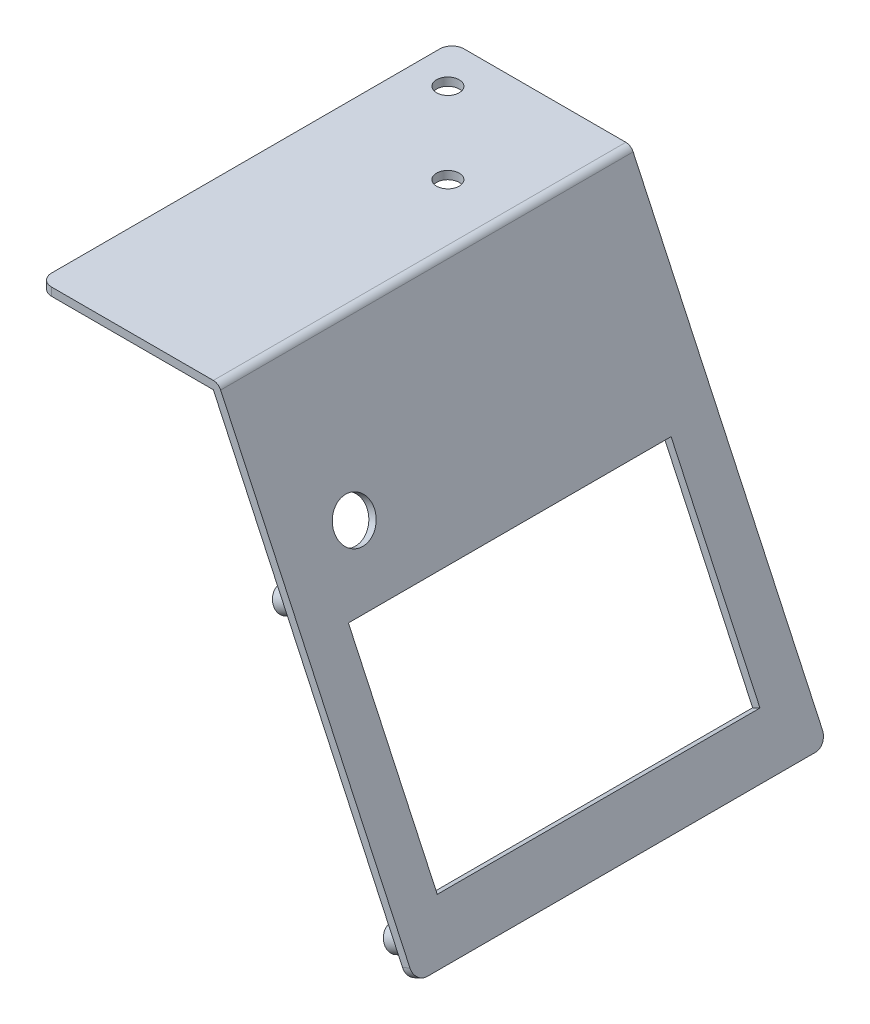
ISO-10303-21;
HEADER;
FILE_DESCRIPTION(('STEP AP214'),'2;1');
FILE_NAME('part.step','',(''),(''),'','','');
FILE_SCHEMA(('AUTOMOTIVE_DESIGN { 1 0 10303 214 1 1 1 1 }'));
ENDSEC;
DATA;
#1=APPLICATION_CONTEXT('core data for automotive mechanical design processes');
#2=APPLICATION_PROTOCOL_DEFINITION('international standard','automotive_design',2000,#1);
#3=PRODUCT_CONTEXT('',#1,'mechanical');
#4=PRODUCT('Part','Part','',(#3));
#5=PRODUCT_RELATED_PRODUCT_CATEGORY('part','',(#4));
#6=PRODUCT_DEFINITION_FORMATION('','',#4);
#7=PRODUCT_DEFINITION_CONTEXT('part definition',#1,'design');
#8=PRODUCT_DEFINITION('design','',#6,#7);
#9=PRODUCT_DEFINITION_SHAPE('','',#8);
#10=(LENGTH_UNIT() NAMED_UNIT(*) SI_UNIT(.MILLI.,.METRE.));
#11=(NAMED_UNIT(*) PLANE_ANGLE_UNIT() SI_UNIT($,.RADIAN.));
#12=(NAMED_UNIT(*) SI_UNIT($,.STERADIAN.) SOLID_ANGLE_UNIT());
#13=UNCERTAINTY_MEASURE_WITH_UNIT(LENGTH_MEASURE(1.E-05),#10,'distance_accuracy_value','');
#14=(GEOMETRIC_REPRESENTATION_CONTEXT(3) GLOBAL_UNCERTAINTY_ASSIGNED_CONTEXT((#13)) GLOBAL_UNIT_ASSIGNED_CONTEXT((#10,
#11,#12)) REPRESENTATION_CONTEXT('',''));
#15=CARTESIAN_POINT('',(0.,0.,0.));
#16=DIRECTION('',(0.,0.,1.));
#17=DIRECTION('',(1.,0.,0.));
#18=AXIS2_PLACEMENT_3D('',#15,#16,#17);
#19=CARTESIAN_POINT('',(34.5538891651414,16.1127431367447,0.));
#20=DIRECTION('',(0.906307787036648,0.422618261740704,0.));
#21=DIRECTION('',(-0.422618261740704,0.906307787036648,0.));
#22=AXIS2_PLACEMENT_3D('',#19,#20,#21);
#23=PLANE('',#22);
#24=CARTESIAN_POINT('',(61.1600718501967,-40.9443997596972,8.04999999999999));
#25=DIRECTION('',(0.906307787036648,0.422618261740704,0.));
#26=DIRECTION('',(-0.422618261740704,0.906307787036648,0.));
#27=AXIS2_PLACEMENT_3D('',#24,#25,#26);
#28=CIRCLE('',#27,1.35);
#29=CARTESIAN_POINT('',(60.5895371968468,-39.7208842471977,8.04999999999999));
#30=VERTEX_POINT('',#29);
#31=EDGE_CURVE('E19',#30,#30,#28,.F.);
#32=ORIENTED_EDGE('',*,*,#31,.T.);
#33=EDGE_LOOP('',(#32));
#34=FACE_BOUND('',#33,.T.);
#35=ADVANCED_FACE('F16',(#34),#23,.F.);
#36=CARTESIAN_POINT('',(34.5538891651414,16.1127431367447,0.));
#37=DIRECTION('',(0.906307787036648,0.422618261740704,0.));
#38=DIRECTION('',(-0.422618261740704,0.906307787036648,0.));
#39=AXIS2_PLACEMENT_3D('',#36,#37,#38);
#40=PLANE('',#39);
#41=CARTESIAN_POINT('',(88.5879970371684,-99.7637751383756,8.04999999999999));
#42=DIRECTION('',(0.906307787036648,0.422618261740704,0.));
#43=DIRECTION('',(-0.422618261740704,0.906307787036648,0.));
#44=AXIS2_PLACEMENT_3D('',#41,#42,#43);
#45=CIRCLE('',#44,1.34999999999999);
#46=CARTESIAN_POINT('',(88.0174623838184,-98.5402596258762,8.04999999999999));
#47=VERTEX_POINT('',#46);
#48=EDGE_CURVE('E232',#47,#47,#45,.F.);
#49=ORIENTED_EDGE('',*,*,#48,.T.);
#50=EDGE_LOOP('',(#49));
#51=FACE_BOUND('',#50,.T.);
#52=ADVANCED_FACE('F381',(#51),#40,.F.);
#53=CARTESIAN_POINT('',(34.5538891651414,16.1127431367447,0.));
#54=DIRECTION('',(0.906307787036648,0.422618261740704,0.));
#55=DIRECTION('',(-0.422618261740704,0.906307787036648,0.));
#56=AXIS2_PLACEMENT_3D('',#53,#54,#55);
#57=PLANE('',#56);
#58=CARTESIAN_POINT('',(88.5879970371684,-99.7637751383756,95.95));
#59=DIRECTION('',(0.906307787036648,0.422618261740704,0.));
#60=DIRECTION('',(-0.422618261740704,0.906307787036648,0.));
#61=AXIS2_PLACEMENT_3D('',#58,#59,#60);
#62=CIRCLE('',#61,1.35000000000001);
#63=CARTESIAN_POINT('',(88.0174623838184,-98.5402596258762,95.95));
#64=VERTEX_POINT('',#63);
#65=EDGE_CURVE('E230',#64,#64,#62,.F.);
#66=ORIENTED_EDGE('',*,*,#65,.T.);
#67=EDGE_LOOP('',(#66));
#68=FACE_BOUND('',#67,.T.);
#69=ADVANCED_FACE('F254',(#68),#57,.F.);
#70=CARTESIAN_POINT('',(34.5538891651414,16.1127431367447,0.));
#71=DIRECTION('',(0.906307787036648,0.422618261740704,0.));
#72=DIRECTION('',(-0.422618261740704,0.906307787036648,0.));
#73=AXIS2_PLACEMENT_3D('',#70,#71,#72);
#74=PLANE('',#73);
#75=CARTESIAN_POINT('',(61.1600718501967,-40.9443997596972,95.95));
#76=DIRECTION('',(0.906307787036648,0.422618261740704,0.));
#77=DIRECTION('',(-0.422618261740704,0.906307787036648,0.));
#78=AXIS2_PLACEMENT_3D('',#75,#76,#77);
#79=CIRCLE('',#78,1.35000000000001);
#80=CARTESIAN_POINT('',(60.5895371968467,-39.7208842471977,95.95));
#81=VERTEX_POINT('',#80);
#82=EDGE_CURVE('E227',#81,#81,#79,.F.);
#83=ORIENTED_EDGE('',*,*,#82,.T.);
#84=EDGE_LOOP('',(#83));
#85=FACE_BOUND('',#84,.T.);
#86=ADVANCED_FACE('F243',(#85),#74,.F.);
#87=CARTESIAN_POINT('',(54.8159173409402,-43.9027275918821,8.04999999999999));
#88=DIRECTION('',(0.906307787036648,0.422618261740704,0.));
#89=DIRECTION('',(-0.422618261740704,0.906307787036648,0.));
#90=AXIS2_PLACEMENT_3D('',#87,#88,#89);
#91=CYLINDRICAL_SURFACE('',#90,1.35);
#92=CARTESIAN_POINT('',(54.8159173409402,-43.9027275918821,8.04999999999999));
#93=DIRECTION('',(0.906307787036648,0.422618261740704,0.));
#94=DIRECTION('',(-0.422618261740704,0.906307787036648,0.));
#95=AXIS2_PLACEMENT_3D('',#92,#93,#94);
#96=CIRCLE('',#95,1.35);
#97=CARTESIAN_POINT('',(54.2453826875902,-42.6792120793826,8.04999999999999));
#98=VERTEX_POINT('',#97);
#99=EDGE_CURVE('E224',#98,#98,#96,.F.);
#100=ORIENTED_EDGE('',*,*,#99,.T.);
#101=EDGE_LOOP('',(#100));
#102=FACE_BOUND('',#101,.T.);
#103=ORIENTED_EDGE('',*,*,#31,.F.);
#104=EDGE_LOOP('',(#103));
#105=FACE_BOUND('',#104,.T.);
#106=ADVANCED_FACE('F240',(#102,#105),#91,.F.);
#107=CARTESIAN_POINT('',(82.2438425279118,-102.722102970561,8.04999999999999));
#108=DIRECTION('',(0.906307787036648,0.422618261740704,0.));
#109=DIRECTION('',(-0.422618261740704,0.906307787036648,0.));
#110=AXIS2_PLACEMENT_3D('',#107,#108,#109);
#111=CYLINDRICAL_SURFACE('',#110,1.34999999999999);
#112=CARTESIAN_POINT('',(82.2438425279118,-102.722102970561,8.04999999999999));
#113=DIRECTION('',(0.906307787036648,0.422618261740704,0.));
#114=DIRECTION('',(-0.422618261740704,0.906307787036648,0.));
#115=AXIS2_PLACEMENT_3D('',#112,#113,#114);
#116=CIRCLE('',#115,1.34999999999999);
#117=CARTESIAN_POINT('',(81.6733078745619,-101.498587458061,8.04999999999999));
#118=VERTEX_POINT('',#117);
#119=EDGE_CURVE('E221',#118,#118,#116,.F.);
#120=ORIENTED_EDGE('',*,*,#119,.T.);
#121=EDGE_LOOP('',(#120));
#122=FACE_BOUND('',#121,.T.);
#123=ORIENTED_EDGE('',*,*,#48,.F.);
#124=EDGE_LOOP('',(#123));
#125=FACE_BOUND('',#124,.T.);
#126=ADVANCED_FACE('F242',(#122,#125),#111,.F.);
#127=CARTESIAN_POINT('',(82.2438425279118,-102.722102970561,95.95));
#128=DIRECTION('',(0.906307787036648,0.422618261740704,0.));
#129=DIRECTION('',(-0.422618261740704,0.906307787036648,0.));
#130=AXIS2_PLACEMENT_3D('',#127,#128,#129);
#131=CYLINDRICAL_SURFACE('',#130,1.35000000000001);
#132=CARTESIAN_POINT('',(82.2438425279118,-102.722102970561,95.95));
#133=DIRECTION('',(0.906307787036648,0.422618261740704,0.));
#134=DIRECTION('',(-0.422618261740704,0.906307787036648,0.));
#135=AXIS2_PLACEMENT_3D('',#132,#133,#134);
#136=CIRCLE('',#135,1.35000000000001);
#137=CARTESIAN_POINT('',(81.6733078745619,-101.498587458061,95.95));
#138=VERTEX_POINT('',#137);
#139=EDGE_CURVE('E218',#138,#138,#136,.F.);
#140=ORIENTED_EDGE('',*,*,#139,.T.);
#141=EDGE_LOOP('',(#140));
#142=FACE_BOUND('',#141,.T.);
#143=ORIENTED_EDGE('',*,*,#65,.F.);
#144=EDGE_LOOP('',(#143));
#145=FACE_BOUND('',#144,.T.);
#146=ADVANCED_FACE('F251',(#142,#145),#131,.F.);
#147=CARTESIAN_POINT('',(54.8159173409402,-43.9027275918821,95.95));
#148=DIRECTION('',(0.906307787036648,0.422618261740704,0.));
#149=DIRECTION('',(-0.422618261740704,0.906307787036648,0.));
#150=AXIS2_PLACEMENT_3D('',#147,#148,#149);
#151=CYLINDRICAL_SURFACE('',#150,1.35000000000001);
#152=CARTESIAN_POINT('',(54.8159173409402,-43.9027275918821,95.95));
#153=DIRECTION('',(0.906307787036648,0.422618261740704,0.));
#154=DIRECTION('',(-0.422618261740704,0.906307787036648,0.));
#155=AXIS2_PLACEMENT_3D('',#152,#153,#154);
#156=CIRCLE('',#155,1.35000000000001);
#157=CARTESIAN_POINT('',(54.2453826875902,-42.6792120793826,95.95));
#158=VERTEX_POINT('',#157);
#159=EDGE_CURVE('E142',#158,#158,#156,.F.);
#160=ORIENTED_EDGE('',*,*,#159,.T.);
#161=EDGE_LOOP('',(#160));
#162=FACE_BOUND('',#161,.T.);
#163=ORIENTED_EDGE('',*,*,#82,.F.);
#164=EDGE_LOOP('',(#163));
#165=FACE_BOUND('',#164,.T.);
#166=ADVANCED_FACE('F367',(#162,#165),#151,.F.);
#167=CARTESIAN_POINT('',(54.8159173409402,-43.9027275918821,8.04999999999999));
#168=DIRECTION('',(0.906307787036648,0.422618261740704,0.));
#169=DIRECTION('',(-0.422618261740704,0.906307787036648,0.));
#170=AXIS2_PLACEMENT_3D('',#167,#168,#169);
#171=PLANE('',#170);
#172=CARTESIAN_POINT('',(54.8159173409402,-43.9027275918821,8.04999999999999));
#173=DIRECTION('',(0.906307787036648,0.422618261740704,0.));
#174=DIRECTION('',(-0.422618261740704,0.906307787036648,0.));
#175=AXIS2_PLACEMENT_3D('',#172,#173,#174);
#176=CIRCLE('',#175,3.);
#177=CARTESIAN_POINT('',(53.5480625557181,-41.1838042307722,8.04999999999999));
#178=VERTEX_POINT('',#177);
#179=EDGE_CURVE('E118',#178,#178,#176,.T.);
#180=ORIENTED_EDGE('',*,*,#179,.F.);
#181=EDGE_LOOP('',(#180));
#182=FACE_BOUND('',#181,.T.);
#183=ORIENTED_EDGE('',*,*,#99,.F.);
#184=EDGE_LOOP('',(#183));
#185=FACE_BOUND('',#184,.T.);
#186=ADVANCED_FACE('F363',(#182,#185),#171,.F.);
#187=CARTESIAN_POINT('',(82.2438425279118,-102.722102970561,8.04999999999999));
#188=DIRECTION('',(0.906307787036648,0.422618261740704,0.));
#189=DIRECTION('',(-0.422618261740704,0.906307787036648,0.));
#190=AXIS2_PLACEMENT_3D('',#187,#188,#189);
#191=PLANE('',#190);
#192=CARTESIAN_POINT('',(82.2438425279118,-102.722102970561,8.04999999999999));
#193=DIRECTION('',(0.906307787036648,0.422618261740704,0.));
#194=DIRECTION('',(-0.422618261740704,0.906307787036648,0.));
#195=AXIS2_PLACEMENT_3D('',#192,#193,#194);
#196=CIRCLE('',#195,3.);
#197=CARTESIAN_POINT('',(80.9759877426897,-100.003179609451,8.04999999999999));
#198=VERTEX_POINT('',#197);
#199=EDGE_CURVE('E211',#198,#198,#196,.T.);
#200=ORIENTED_EDGE('',*,*,#199,.F.);
#201=EDGE_LOOP('',(#200));
#202=FACE_BOUND('',#201,.T.);
#203=ORIENTED_EDGE('',*,*,#119,.F.);
#204=EDGE_LOOP('',(#203));
#205=FACE_BOUND('',#204,.T.);
#206=ADVANCED_FACE('F359',(#202,#205),#191,.F.);
#207=CARTESIAN_POINT('',(82.2438425279118,-102.722102970561,95.95));
#208=DIRECTION('',(0.906307787036648,0.422618261740704,0.));
#209=DIRECTION('',(-0.422618261740704,0.906307787036648,0.));
#210=AXIS2_PLACEMENT_3D('',#207,#208,#209);
#211=PLANE('',#210);
#212=CARTESIAN_POINT('',(82.2438425279118,-102.722102970561,95.95));
#213=DIRECTION('',(0.906307787036648,0.422618261740704,0.));
#214=DIRECTION('',(-0.422618261740704,0.906307787036648,0.));
#215=AXIS2_PLACEMENT_3D('',#212,#213,#214);
#216=CIRCLE('',#215,3.);
#217=CARTESIAN_POINT('',(80.9759877426897,-100.003179609451,95.95));
#218=VERTEX_POINT('',#217);
#219=EDGE_CURVE('E208',#218,#218,#216,.T.);
#220=ORIENTED_EDGE('',*,*,#219,.F.);
#221=EDGE_LOOP('',(#220));
#222=FACE_BOUND('',#221,.T.);
#223=ORIENTED_EDGE('',*,*,#139,.F.);
#224=EDGE_LOOP('',(#223));
#225=FACE_BOUND('',#224,.T.);
#226=ADVANCED_FACE('F355',(#222,#225),#211,.F.);
#227=CARTESIAN_POINT('',(54.8159173409402,-43.9027275918821,95.95));
#228=DIRECTION('',(0.906307787036648,0.422618261740704,0.));
#229=DIRECTION('',(-0.422618261740704,0.906307787036648,0.));
#230=AXIS2_PLACEMENT_3D('',#227,#228,#229);
#231=PLANE('',#230);
#232=CARTESIAN_POINT('',(54.8159173409402,-43.9027275918821,95.95));
#233=DIRECTION('',(0.906307787036648,0.422618261740704,0.));
#234=DIRECTION('',(-0.422618261740704,0.906307787036648,0.));
#235=AXIS2_PLACEMENT_3D('',#232,#233,#234);
#236=CIRCLE('',#235,3.00000000000001);
#237=CARTESIAN_POINT('',(53.5480625557181,-41.1838042307722,95.95));
#238=VERTEX_POINT('',#237);
#239=EDGE_CURVE('E205',#238,#238,#236,.T.);
#240=ORIENTED_EDGE('',*,*,#239,.F.);
#241=EDGE_LOOP('',(#240));
#242=FACE_BOUND('',#241,.T.);
#243=ORIENTED_EDGE('',*,*,#159,.F.);
#244=EDGE_LOOP('',(#243));
#245=FACE_BOUND('',#244,.T.);
#246=ADVANCED_FACE('F351',(#242,#245),#231,.F.);
#247=CARTESIAN_POINT('',(28.9999999999989,-8.5,29.9999999999999));
#248=DIRECTION('',(0.,1.,0.));
#249=DIRECTION('',(0.,0.,1.));
#250=AXIS2_PLACEMENT_3D('',#247,#248,#249);
#251=CYLINDRICAL_SURFACE('',#250,2.80000000000107);
#252=CARTESIAN_POINT('',(28.9999999999989,0.,29.9999999999999));
#253=DIRECTION('',(0.,1.,0.));
#254=DIRECTION('',(0.,0.,1.));
#255=AXIS2_PLACEMENT_3D('',#252,#253,#254);
#256=CIRCLE('',#255,2.80000000000107);
#257=CARTESIAN_POINT('',(28.9999999999989,0.,32.800000000001));
#258=VERTEX_POINT('',#257);
#259=EDGE_CURVE('E195',#258,#258,#256,.F.);
#260=ORIENTED_EDGE('',*,*,#259,.F.);
#261=EDGE_LOOP('',(#260));
#262=FACE_BOUND('',#261,.T.);
#263=CARTESIAN_POINT('',(28.9999999999989,-2.,29.9999999999999));
#264=DIRECTION('',(0.,1.,0.));
#265=DIRECTION('',(0.,0.,1.));
#266=AXIS2_PLACEMENT_3D('',#263,#264,#265);
#267=CIRCLE('',#266,2.80000000000107);
#268=CARTESIAN_POINT('',(28.9999999999989,-2.,32.800000000001));
#269=VERTEX_POINT('',#268);
#270=EDGE_CURVE('E202',#269,#269,#267,.F.);
#271=ORIENTED_EDGE('',*,*,#270,.T.);
#272=EDGE_LOOP('',(#271));
#273=FACE_BOUND('',#272,.T.);
#274=ADVANCED_FACE('F347',(#262,#273),#251,.F.);
#275=CARTESIAN_POINT('',(8.99999999999888,-8.5,9.99999999999991));
#276=DIRECTION('',(0.,1.,0.));
#277=DIRECTION('',(0.,0.,1.));
#278=AXIS2_PLACEMENT_3D('',#275,#276,#277);
#279=CYLINDRICAL_SURFACE('',#278,2.80000000000107);
#280=CARTESIAN_POINT('',(8.99999999999888,0.,9.99999999999991));
#281=DIRECTION('',(0.,1.,0.));
#282=DIRECTION('',(0.,0.,1.));
#283=AXIS2_PLACEMENT_3D('',#280,#281,#282);
#284=CIRCLE('',#283,2.80000000000107);
#285=CARTESIAN_POINT('',(8.99999999999888,0.,12.800000000001));
#286=VERTEX_POINT('',#285);
#287=EDGE_CURVE('E192',#286,#286,#284,.F.);
#288=ORIENTED_EDGE('',*,*,#287,.F.);
#289=EDGE_LOOP('',(#288));
#290=FACE_BOUND('',#289,.T.);
#291=CARTESIAN_POINT('',(8.99999999999888,-2.,9.99999999999991));
#292=DIRECTION('',(0.,1.,0.));
#293=DIRECTION('',(0.,0.,1.));
#294=AXIS2_PLACEMENT_3D('',#291,#292,#293);
#295=CIRCLE('',#294,2.80000000000107);
#296=CARTESIAN_POINT('',(8.99999999999888,-2.,12.800000000001));
#297=VERTEX_POINT('',#296);
#298=EDGE_CURVE('E110',#297,#297,#295,.F.);
#299=ORIENTED_EDGE('',*,*,#298,.T.);
#300=EDGE_LOOP('',(#299));
#301=FACE_BOUND('',#300,.T.);
#302=ADVANCED_FACE('F343',(#290,#301),#279,.F.);
#303=CARTESIAN_POINT('',(3.,0.,3.));
#304=DIRECTION('',(0.,1.,0.));
#305=DIRECTION('',(0.,0.,1.));
#306=AXIS2_PLACEMENT_3D('',#303,#304,#305);
#307=CYLINDRICAL_SURFACE('',#306,3.);
#308=CARTESIAN_POINT('',(3.,0.,3.));
#309=DIRECTION('',(0.,1.,0.));
#310=DIRECTION('',(0.,0.,1.));
#311=AXIS2_PLACEMENT_3D('',#308,#309,#310);
#312=CIRCLE('',#311,3.);
#313=CARTESIAN_POINT('',(3.,0.,0.));
#314=VERTEX_POINT('',#313);
#315=CARTESIAN_POINT('',(0.,0.,3.));
#316=VERTEX_POINT('',#315);
#317=EDGE_CURVE('E188',#314,#316,#312,.T.);
#318=ORIENTED_EDGE('',*,*,#317,.F.);
#319=DIRECTION('',(0.,1.,0.));
#320=VECTOR('',#319,1.);
#321=CARTESIAN_POINT('',(3.,0.,0.));
#322=LINE('',#321,#320);
#323=CARTESIAN_POINT('',(3.,-2.,0.));
#324=VERTEX_POINT('',#323);
#325=EDGE_CURVE('E140',#314,#324,#322,.F.);
#326=ORIENTED_EDGE('',*,*,#325,.T.);
#327=CARTESIAN_POINT('',(3.,-2.,3.));
#328=DIRECTION('',(0.,1.,0.));
#329=DIRECTION('',(0.,0.,1.));
#330=AXIS2_PLACEMENT_3D('',#327,#328,#329);
#331=CIRCLE('',#330,3.);
#332=CARTESIAN_POINT('',(0.,-2.,3.));
#333=VERTEX_POINT('',#332);
#334=EDGE_CURVE('E129',#324,#333,#331,.T.);
#335=ORIENTED_EDGE('',*,*,#334,.T.);
#336=DIRECTION('',(0.,1.,0.));
#337=VECTOR('',#336,1.);
#338=CARTESIAN_POINT('',(0.,-2.,3.));
#339=LINE('',#338,#337);
#340=EDGE_CURVE('E137',#316,#333,#339,.F.);
#341=ORIENTED_EDGE('',*,*,#340,.F.);
#342=EDGE_LOOP('',(#318,#326,#335,#341));
#343=FACE_BOUND('',#342,.T.);
#344=ADVANCED_FACE('F339',(#343),#307,.T.);
#345=CARTESIAN_POINT('',(0.,-2.,102.));
#346=DIRECTION('',(-1.,0.,0.));
#347=DIRECTION('',(0.,0.,1.));
#348=AXIS2_PLACEMENT_3D('',#345,#346,#347);
#349=PLANE('',#348);
#350=DIRECTION('',(0.,0.,1.));
#351=VECTOR('',#350,1.);
#352=CARTESIAN_POINT('',(0.,-2.,102.));
#353=LINE('',#352,#351);
#354=CARTESIAN_POINT('',(0.,-2.,99.));
#355=VERTEX_POINT('',#354);
#356=EDGE_CURVE('E198',#333,#355,#353,.T.);
#357=ORIENTED_EDGE('',*,*,#356,.T.);
#358=DIRECTION('',(0.,-1.,0.));
#359=VECTOR('',#358,1.);
#360=CARTESIAN_POINT('',(0.,-2.,99.));
#361=LINE('',#360,#359);
#362=CARTESIAN_POINT('',(0.,0.,99.));
#363=VERTEX_POINT('',#362);
#364=EDGE_CURVE('E98',#363,#355,#361,.T.);
#365=ORIENTED_EDGE('',*,*,#364,.F.);
#366=DIRECTION('',(0.,0.,1.));
#367=VECTOR('',#366,1.);
#368=CARTESIAN_POINT('',(0.,0.,102.));
#369=LINE('',#368,#367);
#370=EDGE_CURVE('E187',#316,#363,#369,.T.);
#371=ORIENTED_EDGE('',*,*,#370,.F.);
#372=ORIENTED_EDGE('',*,*,#340,.T.);
#373=EDGE_LOOP('',(#357,#365,#371,#372));
#374=FACE_BOUND('',#373,.T.);
#375=ADVANCED_FACE('F336',(#374),#349,.T.);
#376=CARTESIAN_POINT('',(3.,-2.,99.));
#377=DIRECTION('',(0.,-1.,0.));
#378=DIRECTION('',(0.,0.,-1.));
#379=AXIS2_PLACEMENT_3D('',#376,#377,#378);
#380=CYLINDRICAL_SURFACE('',#379,3.);
#381=CARTESIAN_POINT('',(3.,0.,99.));
#382=DIRECTION('',(0.,-1.,0.));
#383=DIRECTION('',(0.,0.,-1.));
#384=AXIS2_PLACEMENT_3D('',#381,#382,#383);
#385=CIRCLE('',#384,3.);
#386=CARTESIAN_POINT('',(3.,0.,102.));
#387=VERTEX_POINT('',#386);
#388=EDGE_CURVE('E185',#363,#387,#385,.F.);
#389=ORIENTED_EDGE('',*,*,#388,.F.);
#390=ORIENTED_EDGE('',*,*,#364,.T.);
#391=CARTESIAN_POINT('',(3.,-2.,99.));
#392=DIRECTION('',(0.,-1.,0.));
#393=DIRECTION('',(0.,0.,-1.));
#394=AXIS2_PLACEMENT_3D('',#391,#392,#393);
#395=CIRCLE('',#394,3.);
#396=CARTESIAN_POINT('',(3.,-2.,102.));
#397=VERTEX_POINT('',#396);
#398=EDGE_CURVE('E101',#355,#397,#395,.F.);
#399=ORIENTED_EDGE('',*,*,#398,.T.);
#400=DIRECTION('',(0.,1.,0.));
#401=VECTOR('',#400,1.);
#402=CARTESIAN_POINT('',(3.,0.,102.));
#403=LINE('',#402,#401);
#404=EDGE_CURVE('E104',#397,#387,#403,.T.);
#405=ORIENTED_EDGE('',*,*,#404,.T.);
#406=EDGE_LOOP('',(#389,#390,#399,#405));
#407=FACE_BOUND('',#406,.T.);
#408=ADVANCED_FACE('F103',(#407),#380,.T.);
#409=CARTESIAN_POINT('',(54.8159173409402,-43.9027275918821,8.04999999999999));
#410=DIRECTION('',(0.906307787036648,0.422618261740704,0.));
#411=DIRECTION('',(-0.422618261740704,0.906307787036648,0.));
#412=AXIS2_PLACEMENT_3D('',#409,#410,#411);
#413=CYLINDRICAL_SURFACE('',#412,3.);
#414=CARTESIAN_POINT('',(61.1600718501967,-40.9443997596972,8.04999999999999));
#415=DIRECTION('',(0.906307787036648,0.422618261740704,0.));
#416=DIRECTION('',(-0.422618261740704,0.906307787036648,0.));
#417=AXIS2_PLACEMENT_3D('',#414,#415,#416);
#418=CIRCLE('',#417,3.);
#419=CARTESIAN_POINT('',(59.8922170649746,-38.2254763985872,8.04999999999999));
#420=VERTEX_POINT('',#419);
#421=EDGE_CURVE('E182',#420,#420,#418,.F.);
#422=ORIENTED_EDGE('',*,*,#421,.T.);
#423=EDGE_LOOP('',(#422));
#424=FACE_BOUND('',#423,.T.);
#425=ORIENTED_EDGE('',*,*,#179,.T.);
#426=EDGE_LOOP('',(#425));
#427=FACE_BOUND('',#426,.T.);
#428=ADVANCED_FACE('F329',(#424,#427),#413,.T.);
#429=CARTESIAN_POINT('',(82.2438425279118,-102.722102970561,8.04999999999999));
#430=DIRECTION('',(0.906307787036648,0.422618261740704,0.));
#431=DIRECTION('',(-0.422618261740704,0.906307787036648,0.));
#432=AXIS2_PLACEMENT_3D('',#429,#430,#431);
#433=CYLINDRICAL_SURFACE('',#432,3.);
#434=CARTESIAN_POINT('',(88.5879970371684,-99.7637751383756,8.04999999999999));
#435=DIRECTION('',(0.906307787036648,0.422618261740704,0.));
#436=DIRECTION('',(-0.422618261740704,0.906307787036648,0.));
#437=AXIS2_PLACEMENT_3D('',#434,#435,#436);
#438=CIRCLE('',#437,3.);
#439=CARTESIAN_POINT('',(87.3201422519463,-97.0448517772657,8.04999999999999));
#440=VERTEX_POINT('',#439);
#441=EDGE_CURVE('E179',#440,#440,#438,.F.);
#442=ORIENTED_EDGE('',*,*,#441,.T.);
#443=EDGE_LOOP('',(#442));
#444=FACE_BOUND('',#443,.T.);
#445=ORIENTED_EDGE('',*,*,#199,.T.);
#446=EDGE_LOOP('',(#445));
#447=FACE_BOUND('',#446,.T.);
#448=ADVANCED_FACE('F325',(#444,#447),#433,.T.);
#449=CARTESIAN_POINT('',(82.2438425279118,-102.722102970561,95.95));
#450=DIRECTION('',(0.906307787036648,0.422618261740704,0.));
#451=DIRECTION('',(-0.422618261740704,0.906307787036648,0.));
#452=AXIS2_PLACEMENT_3D('',#449,#450,#451);
#453=CYLINDRICAL_SURFACE('',#452,3.);
#454=CARTESIAN_POINT('',(88.5879970371684,-99.7637751383756,95.95));
#455=DIRECTION('',(0.906307787036648,0.422618261740704,0.));
#456=DIRECTION('',(-0.422618261740704,0.906307787036648,0.));
#457=AXIS2_PLACEMENT_3D('',#454,#455,#456);
#458=CIRCLE('',#457,3.);
#459=CARTESIAN_POINT('',(87.3201422519463,-97.0448517772657,95.95));
#460=VERTEX_POINT('',#459);
#461=EDGE_CURVE('E176',#460,#460,#458,.F.);
#462=ORIENTED_EDGE('',*,*,#461,.T.);
#463=EDGE_LOOP('',(#462));
#464=FACE_BOUND('',#463,.T.);
#465=ORIENTED_EDGE('',*,*,#219,.T.);
#466=EDGE_LOOP('',(#465));
#467=FACE_BOUND('',#466,.T.);
#468=ADVANCED_FACE('F321',(#464,#467),#453,.T.);
#469=CARTESIAN_POINT('',(54.8159173409402,-43.9027275918821,95.95));
#470=DIRECTION('',(0.906307787036648,0.422618261740704,0.));
#471=DIRECTION('',(-0.422618261740704,0.906307787036648,0.));
#472=AXIS2_PLACEMENT_3D('',#469,#470,#471);
#473=CYLINDRICAL_SURFACE('',#472,3.00000000000001);
#474=CARTESIAN_POINT('',(61.1600718501967,-40.9443997596972,95.95));
#475=DIRECTION('',(0.906307787036648,0.422618261740704,0.));
#476=DIRECTION('',(-0.422618261740704,0.906307787036648,0.));
#477=AXIS2_PLACEMENT_3D('',#474,#475,#476);
#478=CIRCLE('',#477,3.00000000000001);
#479=CARTESIAN_POINT('',(59.8922170649746,-38.2254763985872,95.95));
#480=VERTEX_POINT('',#479);
#481=EDGE_CURVE('E173',#480,#480,#478,.F.);
#482=ORIENTED_EDGE('',*,*,#481,.T.);
#483=EDGE_LOOP('',(#482));
#484=FACE_BOUND('',#483,.T.);
#485=ORIENTED_EDGE('',*,*,#239,.T.);
#486=EDGE_LOOP('',(#485));
#487=FACE_BOUND('',#486,.T.);
#488=ADVANCED_FACE('F318',(#484,#487),#473,.T.);
#489=CARTESIAN_POINT('',(0.,-2.,102.));
#490=DIRECTION('',(0.,1.,0.));
#491=DIRECTION('',(0.,0.,1.));
#492=AXIS2_PLACEMENT_3D('',#489,#490,#491);
#493=PLANE('',#492);
#494=ORIENTED_EDGE('',*,*,#334,.F.);
#495=DIRECTION('',(1.,0.,0.));
#496=VECTOR('',#495,1.);
#497=CARTESIAN_POINT('',(0.,-2.,0.));
#498=LINE('',#497,#496);
#499=CARTESIAN_POINT('',(43.,-2.,0.));
#500=VERTEX_POINT('',#499);
#501=EDGE_CURVE('E127',#500,#324,#498,.F.);
#502=ORIENTED_EDGE('',*,*,#501,.F.);
#503=DIRECTION('',(0.,0.,1.));
#504=VECTOR('',#503,1.);
#505=CARTESIAN_POINT('',(43.,-2.00000000000001,0.));
#506=LINE('',#505,#504);
#507=CARTESIAN_POINT('',(43.,-2.,102.));
#508=VERTEX_POINT('',#507);
#509=EDGE_CURVE('E125',#500,#508,#506,.T.);
#510=ORIENTED_EDGE('',*,*,#509,.T.);
#511=DIRECTION('',(1.,0.,0.));
#512=VECTOR('',#511,1.);
#513=CARTESIAN_POINT('',(0.,-2.,102.));
#514=LINE('',#513,#512);
#515=EDGE_CURVE('E109',#397,#508,#514,.T.);
#516=ORIENTED_EDGE('',*,*,#515,.F.);
#517=ORIENTED_EDGE('',*,*,#398,.F.);
#518=ORIENTED_EDGE('',*,*,#356,.F.);
#519=EDGE_LOOP('',(#494,#502,#510,#516,#517,#518));
#520=FACE_BOUND('',#519,.T.);
#521=ORIENTED_EDGE('',*,*,#298,.F.);
#522=EDGE_LOOP('',(#521));
#523=FACE_BOUND('',#522,.T.);
#524=ORIENTED_EDGE('',*,*,#270,.F.);
#525=EDGE_LOOP('',(#524));
#526=FACE_BOUND('',#525,.T.);
#527=ADVANCED_FACE('F121',(#520,#523,#526),#493,.F.);
#528=CARTESIAN_POINT('',(0.,0.,102.));
#529=DIRECTION('',(0.,1.,0.));
#530=DIRECTION('',(0.,0.,1.));
#531=AXIS2_PLACEMENT_3D('',#528,#529,#530);
#532=PLANE('',#531);
#533=DIRECTION('',(1.,0.,0.));
#534=VECTOR('',#533,1.);
#535=CARTESIAN_POINT('',(0.,0.,102.));
#536=LINE('',#535,#534);
#537=CARTESIAN_POINT('',(43.,0.,102.));
#538=VERTEX_POINT('',#537);
#539=EDGE_CURVE('E116',#387,#538,#536,.T.);
#540=ORIENTED_EDGE('',*,*,#539,.T.);
#541=DIRECTION('',(0.,0.,-1.));
#542=VECTOR('',#541,1.);
#543=CARTESIAN_POINT('',(43.,0.,0.));
#544=LINE('',#543,#542);
#545=CARTESIAN_POINT('',(43.,0.,0.));
#546=VERTEX_POINT('',#545);
#547=EDGE_CURVE('E160',#546,#538,#544,.F.);
#548=ORIENTED_EDGE('',*,*,#547,.F.);
#549=DIRECTION('',(1.,0.,0.));
#550=VECTOR('',#549,1.);
#551=CARTESIAN_POINT('',(0.,0.,0.));
#552=LINE('',#551,#550);
#553=EDGE_CURVE('E191',#546,#314,#552,.F.);
#554=ORIENTED_EDGE('',*,*,#553,.T.);
#555=ORIENTED_EDGE('',*,*,#317,.T.);
#556=ORIENTED_EDGE('',*,*,#370,.T.);
#557=ORIENTED_EDGE('',*,*,#388,.T.);
#558=EDGE_LOOP('',(#540,#548,#554,#555,#556,#557));
#559=FACE_BOUND('',#558,.T.);
#560=ORIENTED_EDGE('',*,*,#287,.T.);
#561=EDGE_LOOP('',(#560));
#562=FACE_BOUND('',#561,.T.);
#563=ORIENTED_EDGE('',*,*,#259,.T.);
#564=EDGE_LOOP('',(#563));
#565=FACE_BOUND('',#564,.T.);
#566=ADVANCED_FACE('F311',(#559,#562,#565),#532,.T.);
#567=CARTESIAN_POINT('',(34.5538891651414,16.1127431367447,0.));
#568=DIRECTION('',(0.906307787036648,0.422618261740704,0.));
#569=DIRECTION('',(-0.422618261740704,0.906307787036648,0.));
#570=AXIS2_PLACEMENT_3D('',#567,#568,#569);
#571=PLANE('',#570);
#572=CARTESIAN_POINT('',(89.7947702625005,-102.351708671586,3.));
#573=DIRECTION('',(-0.906307787036648,-0.422618261740704,0.));
#574=DIRECTION('',(0.422618261740704,-0.906307787036648,0.));
#575=AXIS2_PLACEMENT_3D('',#572,#573,#574);
#576=CIRCLE('',#575,3.);
#577=CARTESIAN_POINT('',(91.0626250477226,-105.070632032696,3.));
#578=VERTEX_POINT('',#577);
#579=CARTESIAN_POINT('',(89.7947702625005,-102.351708671586,0.));
#580=VERTEX_POINT('',#579);
#581=EDGE_CURVE('E165',#578,#580,#576,.F.);
#582=ORIENTED_EDGE('',*,*,#581,.F.);
#583=DIRECTION('',(0.,0.,1.));
#584=VECTOR('',#583,1.);
#585=CARTESIAN_POINT('',(91.0626250477226,-105.070632032696,102.));
#586=LINE('',#585,#584);
#587=CARTESIAN_POINT('',(91.0626250477226,-105.070632032696,99.));
#588=VERTEX_POINT('',#587);
#589=EDGE_CURVE('E781',#588,#578,#586,.F.);
#590=ORIENTED_EDGE('',*,*,#589,.F.);
#591=CARTESIAN_POINT('',(89.7947702625005,-102.351708671586,99.));
#592=DIRECTION('',(-0.906307787036648,-0.422618261740704,0.));
#593=DIRECTION('',(0.422618261740704,-0.906307787036648,0.));
#594=AXIS2_PLACEMENT_3D('',#591,#592,#593);
#595=CIRCLE('',#594,3.);
#596=CARTESIAN_POINT('',(89.7947702625005,-102.351708671586,102.));
#597=VERTEX_POINT('',#596);
#598=EDGE_CURVE('E154',#597,#588,#595,.F.);
#599=ORIENTED_EDGE('',*,*,#598,.F.);
#600=DIRECTION('',(0.422618261740704,-0.906307787036648,0.));
#601=VECTOR('',#600,1.);
#602=CARTESIAN_POINT('',(43.,-2.,102.));
#603=LINE('',#602,#601);
#604=EDGE_CURVE('E159',#508,#597,#603,.T.);
#605=ORIENTED_EDGE('',*,*,#604,.F.);
#606=ORIENTED_EDGE('',*,*,#509,.F.);
#607=DIRECTION('',(-0.422618261740704,0.906307787036648,0.));
#608=VECTOR('',#607,1.);
#609=CARTESIAN_POINT('',(89.7947702625005,-102.351708671586,0.));
#610=LINE('',#609,#608);
#611=EDGE_CURVE('E164',#580,#500,#610,.T.);
#612=ORIENTED_EDGE('',*,*,#611,.F.);
#613=EDGE_LOOP('',(#582,#590,#599,#605,#606,#612));
#614=FACE_BOUND('',#613,.T.);
#615=DIRECTION('',(0.422618261740704,-0.906307787036648,0.));
#616=VECTOR('',#615,1.);
#617=CARTESIAN_POINT('',(63.8859596384243,-46.7900849860836,91.3));
#618=LINE('',#617,#616);
#619=CARTESIAN_POINT('',(63.8859596384243,-46.7900849860836,91.3));
#620=VERTEX_POINT('',#619);
#621=CARTESIAN_POINT('',(85.8621092489408,-93.9180899119893,91.3));
#622=VERTEX_POINT('',#621);
#623=EDGE_CURVE('E172',#620,#622,#618,.T.);
#624=ORIENTED_EDGE('',*,*,#623,.T.);
#625=DIRECTION('',(0.,0.,1.));
#626=VECTOR('',#625,1.);
#627=CARTESIAN_POINT('',(85.8621092489408,-93.9180899119893,91.3));
#628=LINE('',#627,#626);
#629=CARTESIAN_POINT('',(85.8621092489408,-93.9180899119893,11.5000000000001));
#630=VERTEX_POINT('',#629);
#631=EDGE_CURVE('E788',#622,#630,#628,.F.);
#632=ORIENTED_EDGE('',*,*,#631,.T.);
#633=DIRECTION('',(-0.422618261740704,0.906307787036648,0.));
#634=VECTOR('',#633,1.);
#635=CARTESIAN_POINT('',(85.8621092489408,-93.9180899119893,11.5));
#636=LINE('',#635,#634);
#637=CARTESIAN_POINT('',(63.8859596384243,-46.7900849860836,11.5000000000001));
#638=VERTEX_POINT('',#637);
#639=EDGE_CURVE('E794',#630,#638,#636,.T.);
#640=ORIENTED_EDGE('',*,*,#639,.T.);
#641=DIRECTION('',(0.,0.,1.));
#642=VECTOR('',#641,1.);
#643=CARTESIAN_POINT('',(63.8859596384243,-46.7900849860836,91.3));
#644=LINE('',#643,#642);
#645=EDGE_CURVE('E800',#638,#620,#644,.T.);
#646=ORIENTED_EDGE('',*,*,#645,.T.);
#647=EDGE_LOOP('',(#624,#632,#640,#646));
#648=FACE_BOUND('',#647,.T.);
#649=CARTESIAN_POINT('',(57.124067450573,-32.2891603934972,83.1));
#650=DIRECTION('',(0.906307787036648,0.422618261740704,0.));
#651=DIRECTION('',(-0.422618261740704,0.906307787036648,0.));
#652=AXIS2_PLACEMENT_3D('',#649,#650,#651);
#653=CIRCLE('',#652,5.);
#654=CARTESIAN_POINT('',(55.0109761418695,-27.757621458314,83.1));
#655=VERTEX_POINT('',#654);
#656=EDGE_CURVE('E169',#655,#655,#653,.T.);
#657=ORIENTED_EDGE('',*,*,#656,.T.);
#658=EDGE_LOOP('',(#657));
#659=FACE_BOUND('',#658,.T.);
#660=ORIENTED_EDGE('',*,*,#481,.F.);
#661=EDGE_LOOP('',(#660));
#662=FACE_BOUND('',#661,.T.);
#663=ORIENTED_EDGE('',*,*,#461,.F.);
#664=EDGE_LOOP('',(#663));
#665=FACE_BOUND('',#664,.T.);
#666=ORIENTED_EDGE('',*,*,#441,.F.);
#667=EDGE_LOOP('',(#666));
#668=FACE_BOUND('',#667,.T.);
#669=ORIENTED_EDGE('',*,*,#421,.F.);
#670=EDGE_LOOP('',(#669));
#671=FACE_BOUND('',#670,.T.);
#672=ADVANCED_FACE('F307',(#614,#648,#659,#662,#665,#668,#671),#571,.F.);
#673=CARTESIAN_POINT('',(49.8736051542798,-35.6701064874228,83.1));
#674=DIRECTION('',(0.906307787036648,0.422618261740704,0.));
#675=DIRECTION('',(-0.422618261740704,0.906307787036648,0.));
#676=AXIS2_PLACEMENT_3D('',#673,#674,#675);
#677=CYLINDRICAL_SURFACE('',#676,5.);
#678=CARTESIAN_POINT('',(58.9366830246463,-31.4439238700158,83.1));
#679=DIRECTION('',(0.906307787036648,0.422618261740704,0.));
#680=DIRECTION('',(-0.422618261740704,0.906307787036648,0.));
#681=AXIS2_PLACEMENT_3D('',#678,#679,#680);
#682=CIRCLE('',#681,5.);
#683=CARTESIAN_POINT('',(56.8235917159428,-26.9123849348326,83.1));
#684=VERTEX_POINT('',#683);
#685=EDGE_CURVE('E149',#684,#684,#682,.F.);
#686=ORIENTED_EDGE('',*,*,#685,.F.);
#687=EDGE_LOOP('',(#686));
#688=FACE_BOUND('',#687,.T.);
#689=ORIENTED_EDGE('',*,*,#656,.F.);
#690=EDGE_LOOP('',(#689));
#691=FACE_BOUND('',#690,.T.);
#692=ADVANCED_FACE('F303',(#688,#691),#677,.F.);
#693=CARTESIAN_POINT('',(56.6354973421311,-50.1710310800092,91.3));
#694=DIRECTION('',(0.,0.,1.));
#695=DIRECTION('',(1.,0.,0.));
#696=AXIS2_PLACEMENT_3D('',#693,#694,#695);
#697=PLANE('',#696);
#698=DIRECTION('',(-0.422618261740704,0.906307787036648,0.));
#699=VECTOR('',#698,1.);
#700=CARTESIAN_POINT('',(36.3665047392147,16.9579796602261,91.3));
#701=LINE('',#700,#699);
#702=CARTESIAN_POINT('',(87.6747248230141,-93.0728533885079,91.3));
#703=VERTEX_POINT('',#702);
#704=CARTESIAN_POINT('',(65.6985752124976,-45.9448484626022,91.3));
#705=VERTEX_POINT('',#704);
#706=EDGE_CURVE('E152',#703,#705,#701,.T.);
#707=ORIENTED_EDGE('',*,*,#706,.F.);
#708=DIRECTION('',(0.906307787036648,0.422618261740704,0.));
#709=VECTOR('',#708,1.);
#710=CARTESIAN_POINT('',(78.6116469526477,-97.2990360059149,91.3));
#711=LINE('',#710,#709);
#712=EDGE_CURVE('E782',#703,#622,#711,.F.);
#713=ORIENTED_EDGE('',*,*,#712,.T.);
#714=ORIENTED_EDGE('',*,*,#623,.F.);
#715=DIRECTION('',(-0.906307787036648,-0.422618261740704,0.));
#716=VECTOR('',#715,1.);
#717=CARTESIAN_POINT('',(56.6354973421311,-50.1710310800092,91.3));
#718=LINE('',#717,#716);
#719=EDGE_CURVE('E797',#620,#705,#718,.F.);
#720=ORIENTED_EDGE('',*,*,#719,.T.);
#721=EDGE_LOOP('',(#707,#713,#714,#720));
#722=FACE_BOUND('',#721,.T.);
#723=ADVANCED_FACE('F299',(#722),#697,.F.);
#724=CARTESIAN_POINT('',(56.6354973421311,-50.1710310800092,91.3));
#725=DIRECTION('',(-0.422618261740704,0.906307787036648,0.));
#726=DIRECTION('',(-0.906307787036648,-0.422618261740704,0.));
#727=AXIS2_PLACEMENT_3D('',#724,#725,#726);
#728=PLANE('',#727);
#729=DIRECTION('',(0.,0.,1.));
#730=VECTOR('',#729,1.);
#731=CARTESIAN_POINT('',(65.6985752124975,-45.9448484626022,0.));
#732=LINE('',#731,#730);
#733=CARTESIAN_POINT('',(65.6985752124976,-45.9448484626022,11.5000000000001));
#734=VERTEX_POINT('',#733);
#735=EDGE_CURVE('E824',#705,#734,#732,.F.);
#736=ORIENTED_EDGE('',*,*,#735,.F.);
#737=ORIENTED_EDGE('',*,*,#719,.F.);
#738=ORIENTED_EDGE('',*,*,#645,.F.);
#739=DIRECTION('',(0.906307787036648,0.422618261740703,0.));
#740=VECTOR('',#739,1.);
#741=CARTESIAN_POINT('',(63.8859596384243,-46.7900849860836,11.5000000000001));
#742=LINE('',#741,#740);
#743=EDGE_CURVE('E791',#638,#734,#742,.T.);
#744=ORIENTED_EDGE('',*,*,#743,.T.);
#745=EDGE_LOOP('',(#736,#737,#738,#744));
#746=FACE_BOUND('',#745,.T.);
#747=ADVANCED_FACE('F295',(#746),#728,.F.);
#748=CARTESIAN_POINT('',(56.6354973421311,-50.1710310800092,11.5000000000001));
#749=DIRECTION('',(0.,0.,-1.));
#750=DIRECTION('',(0.,1.,0.));
#751=AXIS2_PLACEMENT_3D('',#748,#749,#750);
#752=PLANE('',#751);
#753=DIRECTION('',(-0.422618261740704,0.906307787036648,0.));
#754=VECTOR('',#753,1.);
#755=CARTESIAN_POINT('',(36.3665047392147,16.9579796602261,11.5000000000001));
#756=LINE('',#755,#754);
#757=CARTESIAN_POINT('',(87.6747248230141,-93.0728533885079,11.5000000000001));
#758=VERTEX_POINT('',#757);
#759=EDGE_CURVE('E821',#734,#758,#756,.F.);
#760=ORIENTED_EDGE('',*,*,#759,.F.);
#761=ORIENTED_EDGE('',*,*,#743,.F.);
#762=ORIENTED_EDGE('',*,*,#639,.F.);
#763=DIRECTION('',(0.906307787036648,0.422618261740704,0.));
#764=VECTOR('',#763,1.);
#765=CARTESIAN_POINT('',(78.6116469526477,-97.2990360059149,11.5000000000001));
#766=LINE('',#765,#764);
#767=EDGE_CURVE('E785',#630,#758,#766,.T.);
#768=ORIENTED_EDGE('',*,*,#767,.T.);
#769=EDGE_LOOP('',(#760,#761,#762,#768));
#770=FACE_BOUND('',#769,.T.);
#771=ADVANCED_FACE('F291',(#770),#752,.F.);
#772=CARTESIAN_POINT('',(78.6116469526477,-97.2990360059149,91.3));
#773=DIRECTION('',(0.422618261740704,-0.906307787036648,0.));
#774=DIRECTION('',(0.906307787036648,0.422618261740704,0.));
#775=AXIS2_PLACEMENT_3D('',#772,#773,#774);
#776=PLANE('',#775);
#777=DIRECTION('',(0.,0.,1.));
#778=VECTOR('',#777,1.);
#779=CARTESIAN_POINT('',(87.6747248230141,-93.0728533885079,0.));
#780=LINE('',#779,#778);
#781=EDGE_CURVE('E818',#758,#703,#780,.T.);
#782=ORIENTED_EDGE('',*,*,#781,.F.);
#783=ORIENTED_EDGE('',*,*,#767,.F.);
#784=ORIENTED_EDGE('',*,*,#631,.F.);
#785=ORIENTED_EDGE('',*,*,#712,.F.);
#786=EDGE_LOOP('',(#782,#783,#784,#785));
#787=FACE_BOUND('',#786,.T.);
#788=ADVANCED_FACE('F287',(#787),#776,.F.);
#789=CARTESIAN_POINT('',(92.8752406217959,-104.225395509215,102.));
#790=DIRECTION('',(0.422618261740704,-0.906307787036648,0.));
#791=DIRECTION('',(0.906307787036648,0.422618261740704,0.));
#792=AXIS2_PLACEMENT_3D('',#789,#790,#791);
#793=PLANE('',#792);
#794=DIRECTION('',(0.,0.,1.));
#795=VECTOR('',#794,1.);
#796=CARTESIAN_POINT('',(92.8752406217959,-104.225395509215,0.));
#797=LINE('',#796,#795);
#798=CARTESIAN_POINT('',(92.8752406217959,-104.225395509215,99.));
#799=VERTEX_POINT('',#798);
#800=CARTESIAN_POINT('',(92.8752406217959,-104.225395509215,3.));
#801=VERTEX_POINT('',#800);
#802=EDGE_CURVE('E148',#799,#801,#797,.F.);
#803=ORIENTED_EDGE('',*,*,#802,.F.);
#804=DIRECTION('',(-0.906307787036648,-0.422618261740704,0.));
#805=VECTOR('',#804,1.);
#806=CARTESIAN_POINT('',(92.8752406217959,-104.225395509215,99.));
#807=LINE('',#806,#805);
#808=EDGE_CURVE('E153',#588,#799,#807,.F.);
#809=ORIENTED_EDGE('',*,*,#808,.F.);
#810=ORIENTED_EDGE('',*,*,#589,.T.);
#811=DIRECTION('',(-0.906307787036648,-0.422618261740704,0.));
#812=VECTOR('',#811,1.);
#813=CARTESIAN_POINT('',(92.8752406217959,-104.225395509215,3.));
#814=LINE('',#813,#812);
#815=EDGE_CURVE('E168',#801,#578,#814,.T.);
#816=ORIENTED_EDGE('',*,*,#815,.F.);
#817=EDGE_LOOP('',(#803,#809,#810,#816));
#818=FACE_BOUND('',#817,.T.);
#819=ADVANCED_FACE('F283',(#818),#793,.T.);
#820=CARTESIAN_POINT('',(91.6073858365738,-101.506472148105,3.));
#821=DIRECTION('',(-0.906307787036648,-0.422618261740704,0.));
#822=DIRECTION('',(0.422618261740704,-0.906307787036648,0.));
#823=AXIS2_PLACEMENT_3D('',#820,#821,#822);
#824=CYLINDRICAL_SURFACE('',#823,3.);
#825=ORIENTED_EDGE('',*,*,#581,.T.);
#826=DIRECTION('',(-0.906307787036647,-0.422618261740706,0.));
#827=VECTOR('',#826,1.);
#828=CARTESIAN_POINT('',(91.6073858365738,-101.506472148105,0.));
#829=LINE('',#828,#827);
#830=CARTESIAN_POINT('',(91.6073858365738,-101.506472148105,0.));
#831=VERTEX_POINT('',#830);
#832=EDGE_CURVE('E167',#831,#580,#829,.T.);
#833=ORIENTED_EDGE('',*,*,#832,.F.);
#834=CARTESIAN_POINT('',(91.6073858365738,-101.506472148105,3.));
#835=DIRECTION('',(-0.906307787036648,-0.422618261740704,0.));
#836=DIRECTION('',(0.422618261740704,-0.906307787036648,0.));
#837=AXIS2_PLACEMENT_3D('',#834,#835,#836);
#838=CIRCLE('',#837,3.);
#839=EDGE_CURVE('E144',#801,#831,#838,.F.);
#840=ORIENTED_EDGE('',*,*,#839,.F.);
#841=ORIENTED_EDGE('',*,*,#815,.T.);
#842=EDGE_LOOP('',(#825,#833,#840,#841));
#843=FACE_BOUND('',#842,.T.);
#844=ADVANCED_FACE('F279',(#843),#824,.T.);
#845=CARTESIAN_POINT('',(92.8752406217959,-104.225395509215,0.));
#846=DIRECTION('',(0.,0.,-1.));
#847=DIRECTION('',(-1.,0.,0.));
#848=AXIS2_PLACEMENT_3D('',#845,#846,#847);
#849=PLANE('',#848);
#850=ORIENTED_EDGE('',*,*,#611,.T.);
#851=ORIENTED_EDGE('',*,*,#501,.T.);
#852=ORIENTED_EDGE('',*,*,#325,.F.);
#853=ORIENTED_EDGE('',*,*,#553,.F.);
#854=CARTESIAN_POINT('',(43.,-2.,0.));
#855=DIRECTION('',(0.,0.,-1.));
#856=DIRECTION('',(-1.,0.,0.));
#857=AXIS2_PLACEMENT_3D('',#854,#855,#856);
#858=CIRCLE('',#857,2.);
#859=CARTESIAN_POINT('',(44.8126155740733,-1.15476347651859,0.));
#860=VERTEX_POINT('',#859);
#861=EDGE_CURVE('E161',#860,#546,#858,.F.);
#862=ORIENTED_EDGE('',*,*,#861,.F.);
#863=DIRECTION('',(-0.422618261740704,0.906307787036648,0.));
#864=VECTOR('',#863,1.);
#865=CARTESIAN_POINT('',(36.3665047392147,16.9579796602261,0.));
#866=LINE('',#865,#864);
#867=EDGE_CURVE('E147',#831,#860,#866,.T.);
#868=ORIENTED_EDGE('',*,*,#867,.F.);
#869=ORIENTED_EDGE('',*,*,#832,.T.);
#870=EDGE_LOOP('',(#850,#851,#852,#853,#862,#868,#869));
#871=FACE_BOUND('',#870,.T.);
#872=ADVANCED_FACE('F275',(#871),#849,.T.);
#873=CARTESIAN_POINT('',(43.,-2.,0.));
#874=DIRECTION('',(0.,0.,-1.));
#875=DIRECTION('',(-1.,0.,0.));
#876=AXIS2_PLACEMENT_3D('',#873,#874,#875);
#877=CYLINDRICAL_SURFACE('',#876,2.);
#878=CARTESIAN_POINT('',(43.,-2.,102.));
#879=DIRECTION('',(0.,0.,-1.));
#880=DIRECTION('',(-1.,0.,0.));
#881=AXIS2_PLACEMENT_3D('',#878,#879,#880);
#882=CIRCLE('',#881,2.);
#883=CARTESIAN_POINT('',(44.8126155740733,-1.15476347651859,102.));
#884=VERTEX_POINT('',#883);
#885=EDGE_CURVE('E157',#538,#884,#882,.T.);
#886=ORIENTED_EDGE('',*,*,#885,.T.);
#887=DIRECTION('',(0.,0.,1.));
#888=VECTOR('',#887,1.);
#889=CARTESIAN_POINT('',(44.8126155740733,-1.1547634765186,0.));
#890=LINE('',#889,#888);
#891=EDGE_CURVE('E777',#860,#884,#890,.T.);
#892=ORIENTED_EDGE('',*,*,#891,.F.);
#893=ORIENTED_EDGE('',*,*,#861,.T.);
#894=ORIENTED_EDGE('',*,*,#547,.T.);
#895=EDGE_LOOP('',(#886,#892,#893,#894));
#896=FACE_BOUND('',#895,.T.);
#897=ADVANCED_FACE('F272',(#896),#877,.T.);
#898=CARTESIAN_POINT('',(44.8126155740733,-1.15476347651859,102.));
#899=DIRECTION('',(0.,0.,1.));
#900=DIRECTION('',(1.,0.,0.));
#901=AXIS2_PLACEMENT_3D('',#898,#899,#900);
#902=PLANE('',#901);
#903=DIRECTION('',(-0.422618261740704,0.906307787036648,0.));
#904=VECTOR('',#903,1.);
#905=CARTESIAN_POINT('',(36.3665047392147,16.9579796602261,102.));
#906=LINE('',#905,#904);
#907=CARTESIAN_POINT('',(91.6073858365738,-101.506472148105,102.));
#908=VERTEX_POINT('',#907);
#909=EDGE_CURVE('E25',#884,#908,#906,.F.);
#910=ORIENTED_EDGE('',*,*,#909,.F.);
#911=ORIENTED_EDGE('',*,*,#885,.F.);
#912=ORIENTED_EDGE('',*,*,#539,.F.);
#913=ORIENTED_EDGE('',*,*,#404,.F.);
#914=ORIENTED_EDGE('',*,*,#515,.T.);
#915=ORIENTED_EDGE('',*,*,#604,.T.);
#916=DIRECTION('',(-0.906307787036648,-0.422618261740704,0.));
#917=VECTOR('',#916,1.);
#918=CARTESIAN_POINT('',(91.6073858365738,-101.506472148105,102.));
#919=LINE('',#918,#917);
#920=EDGE_CURVE('E34',#908,#597,#919,.T.);
#921=ORIENTED_EDGE('',*,*,#920,.F.);
#922=EDGE_LOOP('',(#910,#911,#912,#913,#914,#915,#921));
#923=FACE_BOUND('',#922,.T.);
#924=ADVANCED_FACE('F113',(#923),#902,.T.);
#925=CARTESIAN_POINT('',(91.6073858365738,-101.506472148105,99.));
#926=DIRECTION('',(-0.906307787036648,-0.422618261740704,0.));
#927=DIRECTION('',(0.422618261740704,-0.906307787036648,0.));
#928=AXIS2_PLACEMENT_3D('',#925,#926,#927);
#929=CYLINDRICAL_SURFACE('',#928,3.);
#930=ORIENTED_EDGE('',*,*,#598,.T.);
#931=ORIENTED_EDGE('',*,*,#808,.T.);
#932=CARTESIAN_POINT('',(91.6073858365738,-101.506472148105,99.));
#933=DIRECTION('',(-0.906307787036648,-0.422618261740704,0.));
#934=DIRECTION('',(0.422618261740704,-0.906307787036648,0.));
#935=AXIS2_PLACEMENT_3D('',#932,#933,#934);
#936=CIRCLE('',#935,3.);
#937=EDGE_CURVE('E11',#908,#799,#936,.F.);
#938=ORIENTED_EDGE('',*,*,#937,.F.);
#939=ORIENTED_EDGE('',*,*,#920,.T.);
#940=EDGE_LOOP('',(#930,#931,#938,#939));
#941=FACE_BOUND('',#940,.T.);
#942=ADVANCED_FACE('F259',(#941),#929,.T.);
#943=CARTESIAN_POINT('',(36.3665047392147,16.9579796602261,0.));
#944=DIRECTION('',(0.906307787036648,0.422618261740704,0.));
#945=DIRECTION('',(-0.422618261740704,0.906307787036648,0.));
#946=AXIS2_PLACEMENT_3D('',#943,#944,#945);
#947=PLANE('',#946);
#948=ORIENTED_EDGE('',*,*,#909,.T.);
#949=ORIENTED_EDGE('',*,*,#937,.T.);
#950=ORIENTED_EDGE('',*,*,#802,.T.);
#951=ORIENTED_EDGE('',*,*,#839,.T.);
#952=ORIENTED_EDGE('',*,*,#867,.T.);
#953=ORIENTED_EDGE('',*,*,#891,.T.);
#954=EDGE_LOOP('',(#948,#949,#950,#951,#952,#953));
#955=FACE_BOUND('',#954,.T.);
#956=ORIENTED_EDGE('',*,*,#759,.T.);
#957=ORIENTED_EDGE('',*,*,#781,.T.);
#958=ORIENTED_EDGE('',*,*,#706,.T.);
#959=ORIENTED_EDGE('',*,*,#735,.T.);
#960=EDGE_LOOP('',(#956,#957,#958,#959));
#961=FACE_BOUND('',#960,.T.);
#962=ORIENTED_EDGE('',*,*,#685,.T.);
#963=EDGE_LOOP('',(#962));
#964=FACE_BOUND('',#963,.T.);
#965=ADVANCED_FACE('F257',(#955,#961,#964),#947,.T.);
#966=CLOSED_SHELL('',(#35,#52,#69,#86,#106,#126,#146,#166,#186,#206,#226,#246,#274,#302,#344,
#375,#408,#428,#448,#468,#488,#527,#566,#672,#692,#723,#747,#771,#788,#819,#844,#872,#897,#924,
#942,#965));
#967=MANIFOLD_SOLID_BREP('B1',#966);
#968=ADVANCED_BREP_SHAPE_REPRESENTATION('',(#18,#967),#14);
#969=SHAPE_DEFINITION_REPRESENTATION(#9,#968);
ENDSEC;
END-ISO-10303-21;
